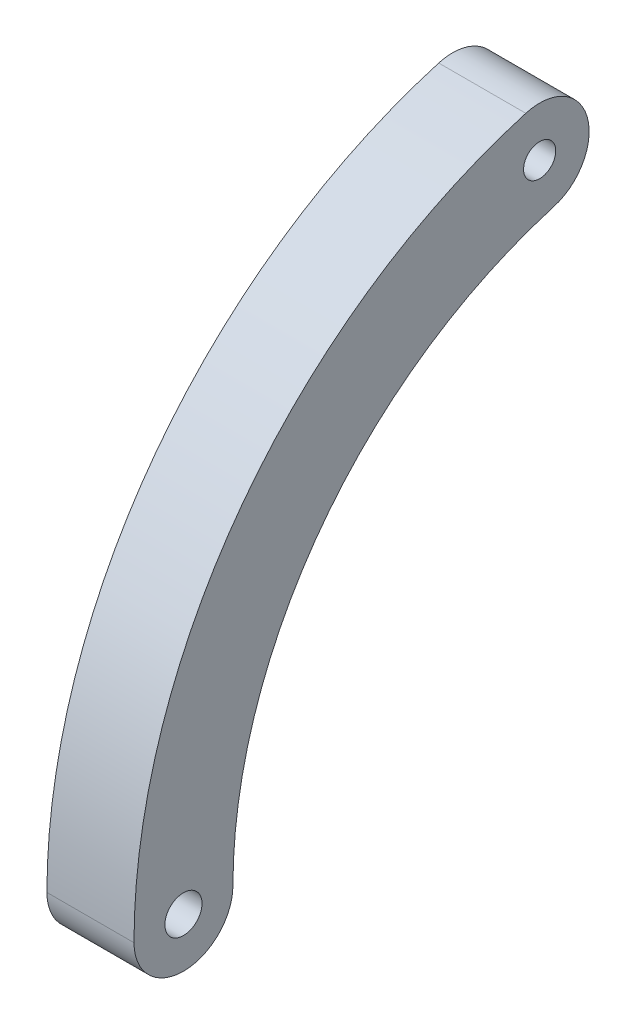
ISO-10303-21;
HEADER;
FILE_DESCRIPTION(('STEP AP214'),'2;1');
FILE_NAME('part.step','',(''),(''),'','','');
FILE_SCHEMA(('AUTOMOTIVE_DESIGN { 1 0 10303 214 1 1 1 1 }'));
ENDSEC;
DATA;
#1=APPLICATION_CONTEXT('core data for automotive mechanical design processes');
#2=APPLICATION_PROTOCOL_DEFINITION('international standard','automotive_design',2000,#1);
#3=PRODUCT_CONTEXT('',#1,'mechanical');
#4=PRODUCT('Part','Part','',(#3));
#5=PRODUCT_RELATED_PRODUCT_CATEGORY('part','',(#4));
#6=PRODUCT_DEFINITION_FORMATION('','',#4);
#7=PRODUCT_DEFINITION_CONTEXT('part definition',#1,'design');
#8=PRODUCT_DEFINITION('design','',#6,#7);
#9=PRODUCT_DEFINITION_SHAPE('','',#8);
#10=(LENGTH_UNIT() NAMED_UNIT(*) SI_UNIT(.MILLI.,.METRE.));
#11=(NAMED_UNIT(*) PLANE_ANGLE_UNIT() SI_UNIT($,.RADIAN.));
#12=(NAMED_UNIT(*) SI_UNIT($,.STERADIAN.) SOLID_ANGLE_UNIT());
#13=UNCERTAINTY_MEASURE_WITH_UNIT(LENGTH_MEASURE(1.E-05),#10,'distance_accuracy_value','');
#14=(GEOMETRIC_REPRESENTATION_CONTEXT(3) GLOBAL_UNCERTAINTY_ASSIGNED_CONTEXT((#13)) GLOBAL_UNIT_ASSIGNED_CONTEXT((#10,
#11,#12)) REPRESENTATION_CONTEXT('',''));
#15=CARTESIAN_POINT('',(0.,0.,0.));
#16=DIRECTION('',(0.,0.,1.));
#17=DIRECTION('',(1.,0.,0.));
#18=AXIS2_PLACEMENT_3D('',#15,#16,#17);
#19=CARTESIAN_POINT('',(5.588,0.,15.875));
#20=DIRECTION('',(1.,0.,0.));
#21=DIRECTION('',(0.,0.,-1.));
#22=AXIS2_PLACEMENT_3D('',#19,#20,#21);
#23=PLANE('',#22);
#24=CARTESIAN_POINT('',(5.588,30.48,8.88999999999999));
#25=DIRECTION('',(1.,0.,0.));
#26=DIRECTION('',(0.,0.,-1.));
#27=AXIS2_PLACEMENT_3D('',#24,#25,#26);
#28=CIRCLE('',#27,1.03187500000001);
#29=CARTESIAN_POINT('',(5.588,30.48,7.85812499999999));
#30=VERTEX_POINT('',#29);
#31=EDGE_CURVE('E102',#30,#30,#28,.T.);
#32=ORIENTED_EDGE('',*,*,#31,.F.);
#33=EDGE_LOOP('',(#32));
#34=FACE_BOUND('',#33,.T.);
#35=CARTESIAN_POINT('',(5.588,0.,31.75));
#36=DIRECTION('',(1.,0.,0.));
#37=DIRECTION('',(0.,0.,-1.));
#38=AXIS2_PLACEMENT_3D('',#35,#36,#37);
#39=CIRCLE('',#38,3.175);
#40=CARTESIAN_POINT('',(5.588,0.,34.925));
#41=VERTEX_POINT('',#40);
#42=CARTESIAN_POINT('',(5.588,0.,28.575));
#43=VERTEX_POINT('',#42);
#44=EDGE_CURVE('E87',#41,#43,#39,.T.);
#45=ORIENTED_EDGE('',*,*,#44,.T.);
#46=CARTESIAN_POINT('',(5.588,0.,0.));
#47=DIRECTION('',(-1.,0.,0.));
#48=DIRECTION('',(0.,0.,1.));
#49=AXIS2_PLACEMENT_3D('',#46,#47,#48);
#50=CIRCLE('',#49,28.575);
#51=CARTESIAN_POINT('',(5.588,27.432,8.00099999999999));
#52=VERTEX_POINT('',#51);
#53=EDGE_CURVE('E82',#43,#52,#50,.T.);
#54=ORIENTED_EDGE('',*,*,#53,.T.);
#55=CARTESIAN_POINT('',(5.588,30.48,8.88999999999999));
#56=DIRECTION('',(1.,0.,0.));
#57=DIRECTION('',(0.,0.,-1.));
#58=AXIS2_PLACEMENT_3D('',#55,#56,#57);
#59=CIRCLE('',#58,3.175);
#60=CARTESIAN_POINT('',(5.588,33.528,9.77899999999999));
#61=VERTEX_POINT('',#60);
#62=EDGE_CURVE('E85',#52,#61,#59,.T.);
#63=ORIENTED_EDGE('',*,*,#62,.T.);
#64=CARTESIAN_POINT('',(5.588,0.,0.));
#65=DIRECTION('',(1.,0.,0.));
#66=DIRECTION('',(0.,0.,1.));
#67=AXIS2_PLACEMENT_3D('',#64,#65,#66);
#68=CIRCLE('',#67,34.925);
#69=EDGE_CURVE('E52',#61,#41,#68,.T.);
#70=ORIENTED_EDGE('',*,*,#69,.T.);
#71=EDGE_LOOP('',(#45,#54,#63,#70));
#72=FACE_BOUND('',#71,.T.);
#73=CARTESIAN_POINT('',(5.588,0.,31.75));
#74=DIRECTION('',(1.,0.,0.));
#75=DIRECTION('',(0.,0.,-1.));
#76=AXIS2_PLACEMENT_3D('',#73,#74,#75);
#77=CIRCLE('',#76,1.190625);
#78=CARTESIAN_POINT('',(5.588,0.,30.559375));
#79=VERTEX_POINT('',#78);
#80=EDGE_CURVE('E117',#79,#79,#77,.T.);
#81=ORIENTED_EDGE('',*,*,#80,.F.);
#82=EDGE_LOOP('',(#81));
#83=FACE_BOUND('',#82,.T.);
#84=ADVANCED_FACE('F35',(#34,#72,#83),#23,.T.);
#85=CARTESIAN_POINT('',(0.,0.,15.875));
#86=DIRECTION('',(1.,0.,0.));
#87=DIRECTION('',(0.,0.,-1.));
#88=AXIS2_PLACEMENT_3D('',#85,#86,#87);
#89=PLANE('',#88);
#90=CARTESIAN_POINT('',(0.,0.,31.75));
#91=DIRECTION('',(1.,0.,0.));
#92=DIRECTION('',(0.,0.,-1.));
#93=AXIS2_PLACEMENT_3D('',#90,#91,#92);
#94=CIRCLE('',#93,3.175);
#95=CARTESIAN_POINT('',(0.,0.,34.925));
#96=VERTEX_POINT('',#95);
#97=CARTESIAN_POINT('',(0.,0.,28.575));
#98=VERTEX_POINT('',#97);
#99=EDGE_CURVE('E99',#96,#98,#94,.T.);
#100=ORIENTED_EDGE('',*,*,#99,.F.);
#101=CARTESIAN_POINT('',(0.,0.,0.));
#102=DIRECTION('',(1.,0.,0.));
#103=DIRECTION('',(0.,0.,1.));
#104=AXIS2_PLACEMENT_3D('',#101,#102,#103);
#105=CIRCLE('',#104,34.925);
#106=CARTESIAN_POINT('',(0.,33.528,9.77899999999999));
#107=VERTEX_POINT('',#106);
#108=EDGE_CURVE('E75',#107,#96,#105,.T.);
#109=ORIENTED_EDGE('',*,*,#108,.F.);
#110=CARTESIAN_POINT('',(0.,30.48,8.88999999999999));
#111=DIRECTION('',(1.,0.,0.));
#112=DIRECTION('',(0.,0.,-1.));
#113=AXIS2_PLACEMENT_3D('',#110,#111,#112);
#114=CIRCLE('',#113,3.175);
#115=CARTESIAN_POINT('',(0.,27.432,8.00099999999999));
#116=VERTEX_POINT('',#115);
#117=EDGE_CURVE('E69',#116,#107,#114,.T.);
#118=ORIENTED_EDGE('',*,*,#117,.F.);
#119=CARTESIAN_POINT('',(0.,0.,0.));
#120=DIRECTION('',(-1.,0.,0.));
#121=DIRECTION('',(0.,0.,1.));
#122=AXIS2_PLACEMENT_3D('',#119,#120,#121);
#123=CIRCLE('',#122,28.575);
#124=EDGE_CURVE('E91',#98,#116,#123,.T.);
#125=ORIENTED_EDGE('',*,*,#124,.F.);
#126=EDGE_LOOP('',(#100,#109,#118,#125));
#127=FACE_BOUND('',#126,.T.);
#128=CARTESIAN_POINT('',(0.,30.48,8.88999999999999));
#129=DIRECTION('',(1.,0.,0.));
#130=DIRECTION('',(0.,0.,-1.));
#131=AXIS2_PLACEMENT_3D('',#128,#129,#130);
#132=CIRCLE('',#131,1.03187500000001);
#133=CARTESIAN_POINT('',(0.,30.48,7.85812499999999));
#134=VERTEX_POINT('',#133);
#135=EDGE_CURVE('E114',#134,#134,#132,.T.);
#136=ORIENTED_EDGE('',*,*,#135,.T.);
#137=EDGE_LOOP('',(#136));
#138=FACE_BOUND('',#137,.T.);
#139=CARTESIAN_POINT('',(0.,0.,31.75));
#140=DIRECTION('',(1.,0.,0.));
#141=DIRECTION('',(0.,0.,-1.));
#142=AXIS2_PLACEMENT_3D('',#139,#140,#141);
#143=CIRCLE('',#142,1.190625);
#144=CARTESIAN_POINT('',(0.,0.,30.559375));
#145=VERTEX_POINT('',#144);
#146=EDGE_CURVE('E120',#145,#145,#143,.T.);
#147=ORIENTED_EDGE('',*,*,#146,.T.);
#148=EDGE_LOOP('',(#147));
#149=FACE_BOUND('',#148,.T.);
#150=ADVANCED_FACE('F110',(#127,#138,#149),#89,.F.);
#151=CARTESIAN_POINT('',(5.588,0.,31.75));
#152=DIRECTION('',(-1.,0.,0.));
#153=DIRECTION('',(0.,0.,1.));
#154=AXIS2_PLACEMENT_3D('',#151,#152,#153);
#155=CYLINDRICAL_SURFACE('',#154,3.175);
#156=ORIENTED_EDGE('',*,*,#99,.T.);
#157=DIRECTION('',(-1.,0.,0.));
#158=VECTOR('',#157,1.);
#159=CARTESIAN_POINT('',(5.588,0.,28.575));
#160=LINE('',#159,#158);
#161=EDGE_CURVE('E11',#43,#98,#160,.T.);
#162=ORIENTED_EDGE('',*,*,#161,.F.);
#163=ORIENTED_EDGE('',*,*,#44,.F.);
#164=DIRECTION('',(-1.,0.,0.));
#165=VECTOR('',#164,1.);
#166=CARTESIAN_POINT('',(5.588,0.,34.925));
#167=LINE('',#166,#165);
#168=EDGE_CURVE('E95',#41,#96,#167,.T.);
#169=ORIENTED_EDGE('',*,*,#168,.T.);
#170=EDGE_LOOP('',(#156,#162,#163,#169));
#171=FACE_BOUND('',#170,.T.);
#172=ADVANCED_FACE('F37',(#171),#155,.T.);
#173=CARTESIAN_POINT('',(5.588,0.,0.));
#174=DIRECTION('',(-1.,0.,0.));
#175=DIRECTION('',(0.,0.,1.));
#176=AXIS2_PLACEMENT_3D('',#173,#174,#175);
#177=CYLINDRICAL_SURFACE('',#176,28.575);
#178=ORIENTED_EDGE('',*,*,#124,.T.);
#179=DIRECTION('',(-1.,0.,0.));
#180=VECTOR('',#179,1.);
#181=CARTESIAN_POINT('',(5.588,27.432,8.00099999999999));
#182=LINE('',#181,#180);
#183=EDGE_CURVE('E44',#52,#116,#182,.T.);
#184=ORIENTED_EDGE('',*,*,#183,.F.);
#185=ORIENTED_EDGE('',*,*,#53,.F.);
#186=ORIENTED_EDGE('',*,*,#161,.T.);
#187=EDGE_LOOP('',(#178,#184,#185,#186));
#188=FACE_BOUND('',#187,.T.);
#189=ADVANCED_FACE('F90',(#188),#177,.F.);
#190=CARTESIAN_POINT('',(5.588,30.48,8.88999999999999));
#191=DIRECTION('',(-1.,0.,0.));
#192=DIRECTION('',(0.,0.,1.));
#193=AXIS2_PLACEMENT_3D('',#190,#191,#192);
#194=CYLINDRICAL_SURFACE('',#193,3.175);
#195=ORIENTED_EDGE('',*,*,#117,.T.);
#196=DIRECTION('',(-1.,0.,0.));
#197=VECTOR('',#196,1.);
#198=CARTESIAN_POINT('',(5.588,33.528,9.77899999999999));
#199=LINE('',#198,#197);
#200=EDGE_CURVE('E92',#61,#107,#199,.T.);
#201=ORIENTED_EDGE('',*,*,#200,.F.);
#202=ORIENTED_EDGE('',*,*,#62,.F.);
#203=ORIENTED_EDGE('',*,*,#183,.T.);
#204=EDGE_LOOP('',(#195,#201,#202,#203));
#205=FACE_BOUND('',#204,.T.);
#206=ADVANCED_FACE('F93',(#205),#194,.T.);
#207=CARTESIAN_POINT('',(5.588,0.,0.));
#208=DIRECTION('',(-1.,0.,0.));
#209=DIRECTION('',(0.,0.,1.));
#210=AXIS2_PLACEMENT_3D('',#207,#208,#209);
#211=CYLINDRICAL_SURFACE('',#210,34.925);
#212=ORIENTED_EDGE('',*,*,#108,.T.);
#213=ORIENTED_EDGE('',*,*,#168,.F.);
#214=ORIENTED_EDGE('',*,*,#69,.F.);
#215=ORIENTED_EDGE('',*,*,#200,.T.);
#216=EDGE_LOOP('',(#212,#213,#214,#215));
#217=FACE_BOUND('',#216,.T.);
#218=ADVANCED_FACE('F107',(#217),#211,.T.);
#219=CARTESIAN_POINT('',(5.588,30.48,8.88999999999999));
#220=DIRECTION('',(-1.,0.,0.));
#221=DIRECTION('',(0.,0.,1.));
#222=AXIS2_PLACEMENT_3D('',#219,#220,#221);
#223=CYLINDRICAL_SURFACE('',#222,1.03187500000001);
#224=ORIENTED_EDGE('',*,*,#31,.T.);
#225=EDGE_LOOP('',(#224));
#226=FACE_BOUND('',#225,.T.);
#227=ORIENTED_EDGE('',*,*,#135,.F.);
#228=EDGE_LOOP('',(#227));
#229=FACE_BOUND('',#228,.T.);
#230=ADVANCED_FACE('F137',(#226,#229),#223,.F.);
#231=CARTESIAN_POINT('',(5.588,0.,31.75));
#232=DIRECTION('',(-1.,0.,0.));
#233=DIRECTION('',(0.,0.,1.));
#234=AXIS2_PLACEMENT_3D('',#231,#232,#233);
#235=CYLINDRICAL_SURFACE('',#234,1.190625);
#236=ORIENTED_EDGE('',*,*,#80,.T.);
#237=EDGE_LOOP('',(#236));
#238=FACE_BOUND('',#237,.T.);
#239=ORIENTED_EDGE('',*,*,#146,.F.);
#240=EDGE_LOOP('',(#239));
#241=FACE_BOUND('',#240,.T.);
#242=ADVANCED_FACE('F126',(#238,#241),#235,.F.);
#243=CLOSED_SHELL('',(#84,#150,#172,#189,#206,#218,#230,#242));
#244=MANIFOLD_SOLID_BREP('B2',#243);
#245=ADVANCED_BREP_SHAPE_REPRESENTATION('',(#18,#244),#14);
#246=SHAPE_DEFINITION_REPRESENTATION(#9,#245);
ENDSEC;
END-ISO-10303-21;
